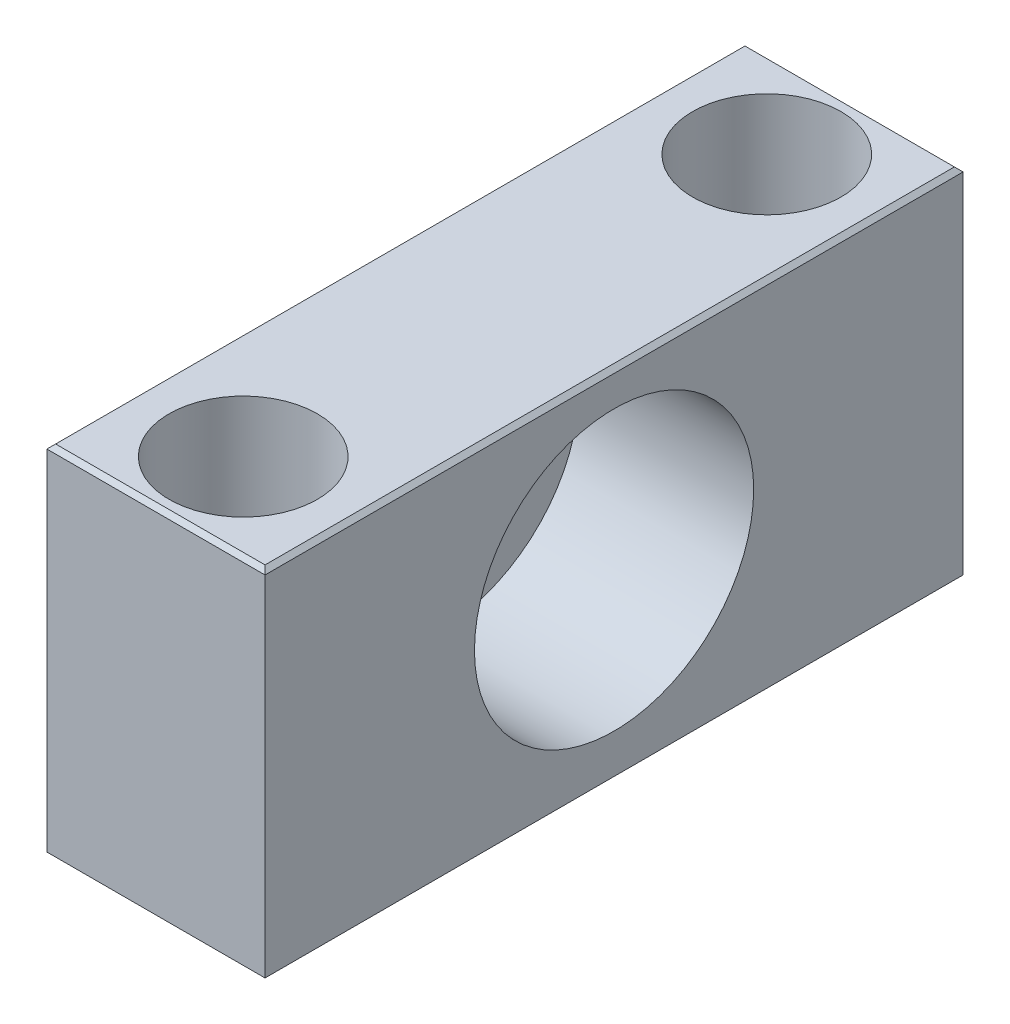
ISO-10303-21;
HEADER;
FILE_DESCRIPTION(('STEP AP214'),'2;1');
FILE_NAME('part.step','',(''),(''),'','','');
FILE_SCHEMA(('AUTOMOTIVE_DESIGN { 1 0 10303 214 1 1 1 1 }'));
ENDSEC;
DATA;
#1=APPLICATION_CONTEXT('core data for automotive mechanical design processes');
#2=APPLICATION_PROTOCOL_DEFINITION('international standard','automotive_design',2000,#1);
#3=PRODUCT_CONTEXT('',#1,'mechanical');
#4=PRODUCT('Part','Part','',(#3));
#5=PRODUCT_RELATED_PRODUCT_CATEGORY('part','',(#4));
#6=PRODUCT_DEFINITION_FORMATION('','',#4);
#7=PRODUCT_DEFINITION_CONTEXT('part definition',#1,'design');
#8=PRODUCT_DEFINITION('design','',#6,#7);
#9=PRODUCT_DEFINITION_SHAPE('','',#8);
#10=(LENGTH_UNIT() NAMED_UNIT(*) SI_UNIT(.MILLI.,.METRE.));
#11=(NAMED_UNIT(*) PLANE_ANGLE_UNIT() SI_UNIT($,.RADIAN.));
#12=(NAMED_UNIT(*) SI_UNIT($,.STERADIAN.) SOLID_ANGLE_UNIT());
#13=UNCERTAINTY_MEASURE_WITH_UNIT(LENGTH_MEASURE(1.E-05),#10,'distance_accuracy_value','');
#14=(GEOMETRIC_REPRESENTATION_CONTEXT(3) GLOBAL_UNCERTAINTY_ASSIGNED_CONTEXT((#13)) GLOBAL_UNIT_ASSIGNED_CONTEXT((#10,
#11,#12)) REPRESENTATION_CONTEXT('',''));
#15=CARTESIAN_POINT('',(0.,0.,0.));
#16=DIRECTION('',(0.,0.,1.));
#17=DIRECTION('',(1.,0.,0.));
#18=AXIS2_PLACEMENT_3D('',#15,#16,#17);
#19=CARTESIAN_POINT('',(19.5,-1.,30.));
#20=DIRECTION('',(0.,-1.,0.));
#21=DIRECTION('',(0.,0.,-1.));
#22=AXIS2_PLACEMENT_3D('',#19,#20,#21);
#23=PLANE('',#22);
#24=CARTESIAN_POINT('',(12.5,-1.,30.));
#25=DIRECTION('',(0.,-1.,0.));
#26=DIRECTION('',(0.,0.,-1.));
#27=AXIS2_PLACEMENT_3D('',#24,#25,#26);
#28=CIRCLE('',#27,5.5);
#29=CARTESIAN_POINT('',(12.5,-1.,24.5));
#30=VERTEX_POINT('',#29);
#31=EDGE_CURVE('E20',#30,#30,#28,.T.);
#32=ORIENTED_EDGE('',*,*,#31,.T.);
#33=EDGE_LOOP('',(#32));
#34=FACE_BOUND('',#33,.T.);
#35=CARTESIAN_POINT('',(12.5,-0.999999999999999,30.));
#36=DIRECTION('',(0.,-1.,0.));
#37=DIRECTION('',(0.,0.,-1.));
#38=AXIS2_PLACEMENT_3D('',#35,#36,#37);
#39=CIRCLE('',#38,8.5);
#40=CARTESIAN_POINT('',(12.5,-0.999999999999999,21.5));
#41=VERTEX_POINT('',#40);
#42=EDGE_CURVE('E148',#41,#41,#39,.F.);
#43=ORIENTED_EDGE('',*,*,#42,.T.);
#44=EDGE_LOOP('',(#43));
#45=FACE_BOUND('',#44,.T.);
#46=ADVANCED_FACE('F17',(#34,#45),#23,.F.);
#47=CARTESIAN_POINT('',(19.5,-1.,-30.));
#48=DIRECTION('',(0.,-1.,0.));
#49=DIRECTION('',(0.,0.,-1.));
#50=AXIS2_PLACEMENT_3D('',#47,#48,#49);
#51=PLANE('',#50);
#52=CARTESIAN_POINT('',(12.5,-1.,-30.));
#53=DIRECTION('',(0.,-1.,0.));
#54=DIRECTION('',(0.,0.,-1.));
#55=AXIS2_PLACEMENT_3D('',#52,#53,#54);
#56=CIRCLE('',#55,5.5);
#57=CARTESIAN_POINT('',(12.5,-1.,-35.5));
#58=VERTEX_POINT('',#57);
#59=EDGE_CURVE('E150',#58,#58,#56,.T.);
#60=ORIENTED_EDGE('',*,*,#59,.T.);
#61=EDGE_LOOP('',(#60));
#62=FACE_BOUND('',#61,.T.);
#63=CARTESIAN_POINT('',(12.5,-0.999999999999999,-30.));
#64=DIRECTION('',(0.,-1.,0.));
#65=DIRECTION('',(0.,0.,-1.));
#66=AXIS2_PLACEMENT_3D('',#63,#64,#65);
#67=CIRCLE('',#66,8.5);
#68=CARTESIAN_POINT('',(12.5,-0.999999999999999,-38.5));
#69=VERTEX_POINT('',#68);
#70=EDGE_CURVE('E145',#69,#69,#67,.F.);
#71=ORIENTED_EDGE('',*,*,#70,.T.);
#72=EDGE_LOOP('',(#71));
#73=FACE_BOUND('',#72,.T.);
#74=ADVANCED_FACE('F162',(#62,#73),#51,.F.);
#75=CARTESIAN_POINT('',(12.5,-11.,30.));
#76=DIRECTION('',(0.,-1.,0.));
#77=DIRECTION('',(0.,0.,-1.));
#78=AXIS2_PLACEMENT_3D('',#75,#76,#77);
#79=CYLINDRICAL_SURFACE('',#78,5.5);
#80=CARTESIAN_POINT('',(12.5,-21.,30.));
#81=DIRECTION('',(0.,-1.,0.));
#82=DIRECTION('',(0.,0.,-1.));
#83=AXIS2_PLACEMENT_3D('',#80,#81,#82);
#84=CIRCLE('',#83,5.5);
#85=CARTESIAN_POINT('',(12.5,-21.,24.5));
#86=VERTEX_POINT('',#85);
#87=EDGE_CURVE('E94',#86,#86,#84,.F.);
#88=ORIENTED_EDGE('',*,*,#87,.F.);
#89=EDGE_LOOP('',(#88));
#90=FACE_BOUND('',#89,.T.);
#91=ORIENTED_EDGE('',*,*,#31,.F.);
#92=EDGE_LOOP('',(#91));
#93=FACE_BOUND('',#92,.T.);
#94=ADVANCED_FACE('F159',(#90,#93),#79,.F.);
#95=CARTESIAN_POINT('',(12.5,-11.,-30.));
#96=DIRECTION('',(0.,-1.,0.));
#97=DIRECTION('',(0.,0.,-1.));
#98=AXIS2_PLACEMENT_3D('',#95,#96,#97);
#99=CYLINDRICAL_SURFACE('',#98,5.5);
#100=CARTESIAN_POINT('',(12.5,-21.,-30.));
#101=DIRECTION('',(0.,-1.,0.));
#102=DIRECTION('',(0.,0.,-1.));
#103=AXIS2_PLACEMENT_3D('',#100,#101,#102);
#104=CIRCLE('',#103,5.5);
#105=CARTESIAN_POINT('',(12.5,-21.,-35.5));
#106=VERTEX_POINT('',#105);
#107=EDGE_CURVE('E107',#106,#106,#104,.F.);
#108=ORIENTED_EDGE('',*,*,#107,.F.);
#109=EDGE_LOOP('',(#108));
#110=FACE_BOUND('',#109,.T.);
#111=ORIENTED_EDGE('',*,*,#59,.F.);
#112=EDGE_LOOP('',(#111));
#113=FACE_BOUND('',#112,.T.);
#114=ADVANCED_FACE('F161',(#110,#113),#99,.F.);
#115=CARTESIAN_POINT('',(15.,0.,0.));
#116=DIRECTION('',(1.,0.,0.));
#117=DIRECTION('',(0.,0.,-1.));
#118=AXIS2_PLACEMENT_3D('',#115,#116,#117);
#119=CYLINDRICAL_SURFACE('',#118,16.);
#120=CARTESIAN_POINT('',(25.,0.,0.));
#121=DIRECTION('',(1.,0.,0.));
#122=DIRECTION('',(0.,0.,-1.));
#123=AXIS2_PLACEMENT_3D('',#120,#121,#122);
#124=CIRCLE('',#123,16.);
#125=CARTESIAN_POINT('',(25.,0.,-16.));
#126=VERTEX_POINT('',#125);
#127=EDGE_CURVE('E137',#126,#126,#124,.F.);
#128=ORIENTED_EDGE('',*,*,#127,.F.);
#129=EDGE_LOOP('',(#128));
#130=FACE_BOUND('',#129,.T.);
#131=CARTESIAN_POINT('',(5.,0.,0.));
#132=DIRECTION('',(1.,0.,0.));
#133=DIRECTION('',(0.,0.,-1.));
#134=AXIS2_PLACEMENT_3D('',#131,#132,#133);
#135=CIRCLE('',#134,16.);
#136=CARTESIAN_POINT('',(5.,0.,-16.));
#137=VERTEX_POINT('',#136);
#138=EDGE_CURVE('E118',#137,#137,#135,.F.);
#139=ORIENTED_EDGE('',*,*,#138,.T.);
#140=EDGE_LOOP('',(#139));
#141=FACE_BOUND('',#140,.T.);
#142=ADVANCED_FACE('F170',(#130,#141),#119,.F.);
#143=CARTESIAN_POINT('',(24.5,-21.,40.));
#144=DIRECTION('',(0.707106781186548,-0.707106781186548,0.));
#145=DIRECTION('',(0.707106781186548,0.707106781186548,0.));
#146=AXIS2_PLACEMENT_3D('',#143,#144,#145);
#147=PLANE('',#146);
#148=DIRECTION('',(-0.577350269189626,-0.577350269189626,-0.577350269189626));
#149=VECTOR('',#148,1.);
#150=CARTESIAN_POINT('',(25.,-20.5,40.));
#151=LINE('',#150,#149);
#152=CARTESIAN_POINT('',(25.,-20.5,40.));
#153=VERTEX_POINT('',#152);
#154=CARTESIAN_POINT('',(24.5,-21.,39.5));
#155=VERTEX_POINT('',#154);
#156=EDGE_CURVE('E99',#153,#155,#151,.T.);
#157=ORIENTED_EDGE('',*,*,#156,.T.);
#158=DIRECTION('',(0.,0.,-1.));
#159=VECTOR('',#158,1.);
#160=CARTESIAN_POINT('',(24.5,-21.,40.));
#161=LINE('',#160,#159);
#162=CARTESIAN_POINT('',(24.5,-21.,-39.5));
#163=VERTEX_POINT('',#162);
#164=EDGE_CURVE('E79',#163,#155,#161,.F.);
#165=ORIENTED_EDGE('',*,*,#164,.F.);
#166=DIRECTION('',(0.577350269189626,0.577350269189626,-0.577350269189626));
#167=VECTOR('',#166,1.);
#168=CARTESIAN_POINT('',(24.5,-21.,-39.5));
#169=LINE('',#168,#167);
#170=CARTESIAN_POINT('',(25.,-20.5,-40.));
#171=VERTEX_POINT('',#170);
#172=EDGE_CURVE('E85',#163,#171,#169,.T.);
#173=ORIENTED_EDGE('',*,*,#172,.T.);
#174=DIRECTION('',(0.,0.,-1.));
#175=VECTOR('',#174,1.);
#176=CARTESIAN_POINT('',(25.,-20.5,40.));
#177=LINE('',#176,#175);
#178=EDGE_CURVE('E488',#153,#171,#177,.T.);
#179=ORIENTED_EDGE('',*,*,#178,.F.);
#180=EDGE_LOOP('',(#157,#165,#173,#179));
#181=FACE_BOUND('',#180,.T.);
#182=ADVANCED_FACE('F97',(#181),#147,.T.);
#183=CARTESIAN_POINT('',(12.5,9.5,30.));
#184=DIRECTION('',(0.,-1.,0.));
#185=DIRECTION('',(0.,0.,-1.));
#186=AXIS2_PLACEMENT_3D('',#183,#184,#185);
#187=CYLINDRICAL_SURFACE('',#186,8.5);
#188=CARTESIAN_POINT('',(12.5,20.,30.));
#189=DIRECTION('',(0.,-1.,0.));
#190=DIRECTION('',(0.,0.,-1.));
#191=AXIS2_PLACEMENT_3D('',#188,#189,#190);
#192=CIRCLE('',#191,8.5);
#193=CARTESIAN_POINT('',(12.5,20.,21.5));
#194=VERTEX_POINT('',#193);
#195=EDGE_CURVE('E133',#194,#194,#192,.T.);
#196=ORIENTED_EDGE('',*,*,#195,.F.);
#197=EDGE_LOOP('',(#196));
#198=FACE_BOUND('',#197,.T.);
#199=ORIENTED_EDGE('',*,*,#42,.F.);
#200=EDGE_LOOP('',(#199));
#201=FACE_BOUND('',#200,.T.);
#202=ADVANCED_FACE('F237',(#198,#201),#187,.F.);
#203=CARTESIAN_POINT('',(12.5,9.5,-30.));
#204=DIRECTION('',(0.,-1.,0.));
#205=DIRECTION('',(0.,0.,-1.));
#206=AXIS2_PLACEMENT_3D('',#203,#204,#205);
#207=CYLINDRICAL_SURFACE('',#206,8.5);
#208=CARTESIAN_POINT('',(12.5,20.,-30.));
#209=DIRECTION('',(0.,-1.,0.));
#210=DIRECTION('',(0.,0.,-1.));
#211=AXIS2_PLACEMENT_3D('',#208,#209,#210);
#212=CIRCLE('',#211,8.5);
#213=CARTESIAN_POINT('',(12.5,20.,-38.5));
#214=VERTEX_POINT('',#213);
#215=EDGE_CURVE('E129',#214,#214,#212,.T.);
#216=ORIENTED_EDGE('',*,*,#215,.F.);
#217=EDGE_LOOP('',(#216));
#218=FACE_BOUND('',#217,.T.);
#219=ORIENTED_EDGE('',*,*,#70,.F.);
#220=EDGE_LOOP('',(#219));
#221=FACE_BOUND('',#220,.T.);
#222=ADVANCED_FACE('F233',(#218,#221),#207,.F.);
#223=CARTESIAN_POINT('',(25.,19.5,40.));
#224=DIRECTION('',(0.707106781186548,0.707106781186548,0.));
#225=DIRECTION('',(-0.707106781186548,0.707106781186548,0.));
#226=AXIS2_PLACEMENT_3D('',#223,#224,#225);
#227=PLANE('',#226);
#228=DIRECTION('',(0.577350269189626,-0.577350269189626,0.577350269189626));
#229=VECTOR('',#228,1.);
#230=CARTESIAN_POINT('',(24.5,20.,39.5));
#231=LINE('',#230,#229);
#232=CARTESIAN_POINT('',(24.5,20.,39.5));
#233=VERTEX_POINT('',#232);
#234=CARTESIAN_POINT('',(25.,19.5,40.));
#235=VERTEX_POINT('',#234);
#236=EDGE_CURVE('E136',#233,#235,#231,.T.);
#237=ORIENTED_EDGE('',*,*,#236,.T.);
#238=DIRECTION('',(0.,0.,-1.));
#239=VECTOR('',#238,1.);
#240=CARTESIAN_POINT('',(25.,19.5,40.));
#241=LINE('',#240,#239);
#242=CARTESIAN_POINT('',(25.,19.5,-40.));
#243=VERTEX_POINT('',#242);
#244=EDGE_CURVE('E139',#243,#235,#241,.F.);
#245=ORIENTED_EDGE('',*,*,#244,.F.);
#246=DIRECTION('',(-0.577350269189626,0.577350269189626,0.577350269189626));
#247=VECTOR('',#246,1.);
#248=CARTESIAN_POINT('',(25.,19.5,-40.));
#249=LINE('',#248,#247);
#250=CARTESIAN_POINT('',(24.5,20.,-39.5));
#251=VERTEX_POINT('',#250);
#252=EDGE_CURVE('E114',#243,#251,#249,.T.);
#253=ORIENTED_EDGE('',*,*,#252,.T.);
#254=DIRECTION('',(0.,0.,1.));
#255=VECTOR('',#254,1.);
#256=CARTESIAN_POINT('',(24.5,20.,40.));
#257=LINE('',#256,#255);
#258=EDGE_CURVE('E128',#233,#251,#257,.F.);
#259=ORIENTED_EDGE('',*,*,#258,.F.);
#260=EDGE_LOOP('',(#237,#245,#253,#259));
#261=FACE_BOUND('',#260,.T.);
#262=ADVANCED_FACE('F229',(#261),#227,.T.);
#263=CARTESIAN_POINT('',(5.,13.,0.));
#264=DIRECTION('',(-1.,0.,0.));
#265=DIRECTION('',(0.,0.,1.));
#266=AXIS2_PLACEMENT_3D('',#263,#264,#265);
#267=PLANE('',#266);
#268=ORIENTED_EDGE('',*,*,#138,.F.);
#269=EDGE_LOOP('',(#268));
#270=FACE_BOUND('',#269,.T.);
#271=CARTESIAN_POINT('',(5.,0.,0.));
#272=DIRECTION('',(1.,0.,0.));
#273=DIRECTION('',(0.,0.,-1.));
#274=AXIS2_PLACEMENT_3D('',#271,#272,#273);
#275=CIRCLE('',#274,10.);
#276=CARTESIAN_POINT('',(5.,0.,-10.));
#277=VERTEX_POINT('',#276);
#278=EDGE_CURVE('E124',#277,#277,#275,.F.);
#279=ORIENTED_EDGE('',*,*,#278,.T.);
#280=EDGE_LOOP('',(#279));
#281=FACE_BOUND('',#280,.T.);
#282=ADVANCED_FACE('F225',(#270,#281),#267,.F.);
#283=CARTESIAN_POINT('',(41.,20.,-39.5));
#284=DIRECTION('',(0.,-0.707106781186548,0.707106781186548));
#285=DIRECTION('',(0.,-0.707106781186548,-0.707106781186548));
#286=AXIS2_PLACEMENT_3D('',#283,#284,#285);
#287=PLANE('',#286);
#288=DIRECTION('',(1.,0.,0.));
#289=VECTOR('',#288,1.);
#290=CARTESIAN_POINT('',(0.,19.5,-40.));
#291=LINE('',#290,#289);
#292=CARTESIAN_POINT('',(0.,19.5,-40.));
#293=VERTEX_POINT('',#292);
#294=EDGE_CURVE('E504',#243,#293,#291,.F.);
#295=ORIENTED_EDGE('',*,*,#294,.T.);
#296=DIRECTION('',(-0.577350269189626,-0.577350269189626,-0.577350269189626));
#297=VECTOR('',#296,1.);
#298=CARTESIAN_POINT('',(0.499999999999987,20.,-39.5));
#299=LINE('',#298,#297);
#300=CARTESIAN_POINT('',(0.49999999999999,20.,-39.5));
#301=VERTEX_POINT('',#300);
#302=EDGE_CURVE('E116',#301,#293,#299,.T.);
#303=ORIENTED_EDGE('',*,*,#302,.F.);
#304=DIRECTION('',(1.,0.,0.));
#305=VECTOR('',#304,1.);
#306=CARTESIAN_POINT('',(24.5,20.,-39.5));
#307=LINE('',#306,#305);
#308=EDGE_CURVE('E132',#251,#301,#307,.F.);
#309=ORIENTED_EDGE('',*,*,#308,.F.);
#310=ORIENTED_EDGE('',*,*,#252,.F.);
#311=EDGE_LOOP('',(#295,#303,#309,#310));
#312=FACE_BOUND('',#311,.T.);
#313=ADVANCED_FACE('F222',(#312),#287,.F.);
#314=CARTESIAN_POINT('',(41.,-20.5,-40.));
#315=DIRECTION('',(0.,0.707106781186548,0.707106781186548));
#316=DIRECTION('',(0.,-0.707106781186548,0.707106781186548));
#317=AXIS2_PLACEMENT_3D('',#314,#315,#316);
#318=PLANE('',#317);
#319=DIRECTION('',(1.,0.,0.));
#320=VECTOR('',#319,1.);
#321=CARTESIAN_POINT('',(0.5,-21.,-39.5));
#322=LINE('',#321,#320);
#323=CARTESIAN_POINT('',(0.499999999999985,-21.,-39.5));
#324=VERTEX_POINT('',#323);
#325=EDGE_CURVE('E87',#324,#163,#322,.T.);
#326=ORIENTED_EDGE('',*,*,#325,.F.);
#327=DIRECTION('',(0.577350269189626,-0.577350269189626,0.577350269189626));
#328=VECTOR('',#327,1.);
#329=CARTESIAN_POINT('',(0.,-20.5,-40.));
#330=LINE('',#329,#328);
#331=CARTESIAN_POINT('',(0.,-20.5,-40.));
#332=VERTEX_POINT('',#331);
#333=EDGE_CURVE('E95',#332,#324,#330,.T.);
#334=ORIENTED_EDGE('',*,*,#333,.F.);
#335=DIRECTION('',(1.,0.,0.));
#336=VECTOR('',#335,1.);
#337=CARTESIAN_POINT('',(0.,-20.5,-40.));
#338=LINE('',#337,#336);
#339=EDGE_CURVE('E90',#332,#171,#338,.T.);
#340=ORIENTED_EDGE('',*,*,#339,.T.);
#341=ORIENTED_EDGE('',*,*,#172,.F.);
#342=EDGE_LOOP('',(#326,#334,#340,#341));
#343=FACE_BOUND('',#342,.T.);
#344=ADVANCED_FACE('F86',(#343),#318,.F.);
#345=CARTESIAN_POINT('',(0.5,-21.,40.));
#346=DIRECTION('',(0.,-1.,0.));
#347=DIRECTION('',(0.,0.,-1.));
#348=AXIS2_PLACEMENT_3D('',#345,#346,#347);
#349=PLANE('',#348);
#350=DIRECTION('',(1.,0.,0.));
#351=VECTOR('',#350,1.);
#352=CARTESIAN_POINT('',(41.,-21.,39.5));
#353=LINE('',#352,#351);
#354=CARTESIAN_POINT('',(0.499999999999991,-21.,39.5));
#355=VERTEX_POINT('',#354);
#356=EDGE_CURVE('E101',#155,#355,#353,.F.);
#357=ORIENTED_EDGE('',*,*,#356,.T.);
#358=DIRECTION('',(0.,0.,1.));
#359=VECTOR('',#358,1.);
#360=CARTESIAN_POINT('',(0.5,-21.,40.));
#361=LINE('',#360,#359);
#362=EDGE_CURVE('E106',#324,#355,#361,.T.);
#363=ORIENTED_EDGE('',*,*,#362,.F.);
#364=ORIENTED_EDGE('',*,*,#325,.T.);
#365=ORIENTED_EDGE('',*,*,#164,.T.);
#366=EDGE_LOOP('',(#357,#363,#364,#365));
#367=FACE_BOUND('',#366,.T.);
#368=ORIENTED_EDGE('',*,*,#107,.T.);
#369=EDGE_LOOP('',(#368));
#370=FACE_BOUND('',#369,.T.);
#371=ORIENTED_EDGE('',*,*,#87,.T.);
#372=EDGE_LOOP('',(#371));
#373=FACE_BOUND('',#372,.T.);
#374=ADVANCED_FACE('F103',(#367,#370,#373),#349,.T.);
#375=CARTESIAN_POINT('',(41.,-21.,39.5));
#376=DIRECTION('',(0.,0.707106781186548,-0.707106781186548));
#377=DIRECTION('',(0.,0.707106781186548,0.707106781186548));
#378=AXIS2_PLACEMENT_3D('',#375,#376,#377);
#379=PLANE('',#378);
#380=DIRECTION('',(1.,0.,0.));
#381=VECTOR('',#380,1.);
#382=CARTESIAN_POINT('',(0.,-20.5,40.));
#383=LINE('',#382,#381);
#384=CARTESIAN_POINT('',(0.,-20.5,40.));
#385=VERTEX_POINT('',#384);
#386=EDGE_CURVE('E494',#385,#153,#383,.T.);
#387=ORIENTED_EDGE('',*,*,#386,.F.);
#388=DIRECTION('',(-0.577350269189626,0.577350269189626,0.577350269189626));
#389=VECTOR('',#388,1.);
#390=CARTESIAN_POINT('',(0.5,-21.,39.5));
#391=LINE('',#390,#389);
#392=EDGE_CURVE('E500',#355,#385,#391,.T.);
#393=ORIENTED_EDGE('',*,*,#392,.F.);
#394=ORIENTED_EDGE('',*,*,#356,.F.);
#395=ORIENTED_EDGE('',*,*,#156,.F.);
#396=EDGE_LOOP('',(#387,#393,#394,#395));
#397=FACE_BOUND('',#396,.T.);
#398=ADVANCED_FACE('F213',(#397),#379,.F.);
#399=CARTESIAN_POINT('',(25.,-20.5,40.));
#400=DIRECTION('',(1.,0.,0.));
#401=DIRECTION('',(0.,0.,-1.));
#402=AXIS2_PLACEMENT_3D('',#399,#400,#401);
#403=PLANE('',#402);
#404=DIRECTION('',(0.,1.,0.));
#405=VECTOR('',#404,1.);
#406=CARTESIAN_POINT('',(25.,0.,40.));
#407=LINE('',#406,#405);
#408=EDGE_CURVE('E485',#153,#235,#407,.T.);
#409=ORIENTED_EDGE('',*,*,#408,.F.);
#410=ORIENTED_EDGE('',*,*,#178,.T.);
#411=DIRECTION('',(0.,1.,0.));
#412=VECTOR('',#411,1.);
#413=CARTESIAN_POINT('',(25.,0.,-40.));
#414=LINE('',#413,#412);
#415=EDGE_CURVE('E127',#171,#243,#414,.T.);
#416=ORIENTED_EDGE('',*,*,#415,.T.);
#417=ORIENTED_EDGE('',*,*,#244,.T.);
#418=EDGE_LOOP('',(#409,#410,#416,#417));
#419=FACE_BOUND('',#418,.T.);
#420=ORIENTED_EDGE('',*,*,#127,.T.);
#421=EDGE_LOOP('',(#420));
#422=FACE_BOUND('',#421,.T.);
#423=ADVANCED_FACE('F210',(#419,#422),#403,.T.);
#424=CARTESIAN_POINT('',(41.,19.5,40.));
#425=DIRECTION('',(0.,-0.707106781186548,-0.707106781186548));
#426=DIRECTION('',(0.,0.707106781186548,-0.707106781186548));
#427=AXIS2_PLACEMENT_3D('',#424,#425,#426);
#428=PLANE('',#427);
#429=DIRECTION('',(1.,0.,0.));
#430=VECTOR('',#429,1.);
#431=CARTESIAN_POINT('',(24.5,20.,39.5));
#432=LINE('',#431,#430);
#433=CARTESIAN_POINT('',(0.499999999999987,20.,39.5));
#434=VERTEX_POINT('',#433);
#435=EDGE_CURVE('E509',#434,#233,#432,.T.);
#436=ORIENTED_EDGE('',*,*,#435,.F.);
#437=DIRECTION('',(0.577350269189626,0.577350269189626,-0.577350269189626));
#438=VECTOR('',#437,1.);
#439=CARTESIAN_POINT('',(0.,19.5,40.));
#440=LINE('',#439,#438);
#441=CARTESIAN_POINT('',(0.,19.5,40.));
#442=VERTEX_POINT('',#441);
#443=EDGE_CURVE('E35',#442,#434,#440,.T.);
#444=ORIENTED_EDGE('',*,*,#443,.F.);
#445=DIRECTION('',(1.,0.,0.));
#446=VECTOR('',#445,1.);
#447=CARTESIAN_POINT('',(0.,19.5,40.));
#448=LINE('',#447,#446);
#449=EDGE_CURVE('E490',#235,#442,#448,.F.);
#450=ORIENTED_EDGE('',*,*,#449,.F.);
#451=ORIENTED_EDGE('',*,*,#236,.F.);
#452=EDGE_LOOP('',(#436,#444,#450,#451));
#453=FACE_BOUND('',#452,.T.);
#454=ADVANCED_FACE('F206',(#453),#428,.F.);
#455=CARTESIAN_POINT('',(24.5,20.,40.));
#456=DIRECTION('',(0.,1.,0.));
#457=DIRECTION('',(0.,0.,1.));
#458=AXIS2_PLACEMENT_3D('',#455,#456,#457);
#459=PLANE('',#458);
#460=ORIENTED_EDGE('',*,*,#435,.T.);
#461=ORIENTED_EDGE('',*,*,#258,.T.);
#462=ORIENTED_EDGE('',*,*,#308,.T.);
#463=DIRECTION('',(0.,0.,1.));
#464=VECTOR('',#463,1.);
#465=CARTESIAN_POINT('',(0.5,20.,40.));
#466=LINE('',#465,#464);
#467=EDGE_CURVE('E123',#434,#301,#466,.F.);
#468=ORIENTED_EDGE('',*,*,#467,.F.);
#469=EDGE_LOOP('',(#460,#461,#462,#468));
#470=FACE_BOUND('',#469,.T.);
#471=ORIENTED_EDGE('',*,*,#215,.T.);
#472=EDGE_LOOP('',(#471));
#473=FACE_BOUND('',#472,.T.);
#474=ORIENTED_EDGE('',*,*,#195,.T.);
#475=EDGE_LOOP('',(#474));
#476=FACE_BOUND('',#475,.T.);
#477=ADVANCED_FACE('F202',(#470,#473,#476),#459,.T.);
#478=CARTESIAN_POINT('',(2.5,0.,0.));
#479=DIRECTION('',(1.,0.,0.));
#480=DIRECTION('',(0.,0.,-1.));
#481=AXIS2_PLACEMENT_3D('',#478,#479,#480);
#482=CYLINDRICAL_SURFACE('',#481,10.);
#483=CARTESIAN_POINT('',(0.,0.,0.));
#484=DIRECTION('',(1.,0.,0.));
#485=DIRECTION('',(0.,0.,-1.));
#486=AXIS2_PLACEMENT_3D('',#483,#484,#485);
#487=CIRCLE('',#486,10.);
#488=CARTESIAN_POINT('',(0.,0.,-10.));
#489=VERTEX_POINT('',#488);
#490=EDGE_CURVE('E119',#489,#489,#487,.T.);
#491=ORIENTED_EDGE('',*,*,#490,.F.);
#492=EDGE_LOOP('',(#491));
#493=FACE_BOUND('',#492,.T.);
#494=ORIENTED_EDGE('',*,*,#278,.F.);
#495=EDGE_LOOP('',(#494));
#496=FACE_BOUND('',#495,.T.);
#497=ADVANCED_FACE('F198',(#493,#496),#482,.F.);
#498=CARTESIAN_POINT('',(0.,0.,-40.));
#499=DIRECTION('',(0.,0.,1.));
#500=DIRECTION('',(1.,0.,0.));
#501=AXIS2_PLACEMENT_3D('',#498,#499,#500);
#502=PLANE('',#501);
#503=DIRECTION('',(0.,1.,0.));
#504=VECTOR('',#503,1.);
#505=CARTESIAN_POINT('',(0.,19.5,-40.));
#506=LINE('',#505,#504);
#507=EDGE_CURVE('E122',#293,#332,#506,.F.);
#508=ORIENTED_EDGE('',*,*,#507,.F.);
#509=ORIENTED_EDGE('',*,*,#294,.F.);
#510=ORIENTED_EDGE('',*,*,#415,.F.);
#511=ORIENTED_EDGE('',*,*,#339,.F.);
#512=EDGE_LOOP('',(#508,#509,#510,#511));
#513=FACE_BOUND('',#512,.T.);
#514=ADVANCED_FACE('F194',(#513),#502,.F.);
#515=CARTESIAN_POINT('',(0.,-20.5,40.));
#516=DIRECTION('',(-0.707106781186548,-0.707106781186548,0.));
#517=DIRECTION('',(0.707106781186548,-0.707106781186548,0.));
#518=AXIS2_PLACEMENT_3D('',#515,#516,#517);
#519=PLANE('',#518);
#520=ORIENTED_EDGE('',*,*,#333,.T.);
#521=ORIENTED_EDGE('',*,*,#362,.T.);
#522=ORIENTED_EDGE('',*,*,#392,.T.);
#523=DIRECTION('',(0.,0.,1.));
#524=VECTOR('',#523,1.);
#525=CARTESIAN_POINT('',(0.,-20.5,40.));
#526=LINE('',#525,#524);
#527=EDGE_CURVE('E518',#332,#385,#526,.T.);
#528=ORIENTED_EDGE('',*,*,#527,.F.);
#529=EDGE_LOOP('',(#520,#521,#522,#528));
#530=FACE_BOUND('',#529,.T.);
#531=ADVANCED_FACE('F190',(#530),#519,.T.);
#532=CARTESIAN_POINT('',(0.,0.,40.));
#533=DIRECTION('',(0.,0.,1.));
#534=DIRECTION('',(1.,0.,0.));
#535=AXIS2_PLACEMENT_3D('',#532,#533,#534);
#536=PLANE('',#535);
#537=ORIENTED_EDGE('',*,*,#449,.T.);
#538=DIRECTION('',(0.,1.,0.));
#539=VECTOR('',#538,1.);
#540=CARTESIAN_POINT('',(0.,19.5,40.));
#541=LINE('',#540,#539);
#542=EDGE_CURVE('E26',#385,#442,#541,.T.);
#543=ORIENTED_EDGE('',*,*,#542,.F.);
#544=ORIENTED_EDGE('',*,*,#386,.T.);
#545=ORIENTED_EDGE('',*,*,#408,.T.);
#546=EDGE_LOOP('',(#537,#543,#544,#545));
#547=FACE_BOUND('',#546,.T.);
#548=ADVANCED_FACE('F182',(#547),#536,.T.);
#549=CARTESIAN_POINT('',(0.5,20.,40.));
#550=DIRECTION('',(-0.707106781186548,0.707106781186548,0.));
#551=DIRECTION('',(-0.707106781186548,-0.707106781186548,0.));
#552=AXIS2_PLACEMENT_3D('',#549,#550,#551);
#553=PLANE('',#552);
#554=ORIENTED_EDGE('',*,*,#302,.T.);
#555=DIRECTION('',(0.,0.,1.));
#556=VECTOR('',#555,1.);
#557=CARTESIAN_POINT('',(0.,19.5,40.));
#558=LINE('',#557,#556);
#559=EDGE_CURVE('E11',#442,#293,#558,.F.);
#560=ORIENTED_EDGE('',*,*,#559,.F.);
#561=ORIENTED_EDGE('',*,*,#443,.T.);
#562=ORIENTED_EDGE('',*,*,#467,.T.);
#563=EDGE_LOOP('',(#554,#560,#561,#562));
#564=FACE_BOUND('',#563,.T.);
#565=ADVANCED_FACE('F176',(#564),#553,.T.);
#566=CARTESIAN_POINT('',(0.,19.5,40.));
#567=DIRECTION('',(-1.,0.,0.));
#568=DIRECTION('',(0.,0.,1.));
#569=AXIS2_PLACEMENT_3D('',#566,#567,#568);
#570=PLANE('',#569);
#571=ORIENTED_EDGE('',*,*,#542,.T.);
#572=ORIENTED_EDGE('',*,*,#559,.T.);
#573=ORIENTED_EDGE('',*,*,#507,.T.);
#574=ORIENTED_EDGE('',*,*,#527,.T.);
#575=EDGE_LOOP('',(#571,#572,#573,#574));
#576=FACE_BOUND('',#575,.T.);
#577=ORIENTED_EDGE('',*,*,#490,.T.);
#578=EDGE_LOOP('',(#577));
#579=FACE_BOUND('',#578,.T.);
#580=ADVANCED_FACE('F174',(#576,#579),#570,.T.);
#581=CLOSED_SHELL('',(#46,#74,#94,#114,#142,#182,#202,#222,#262,#282,#313,#344,#374,#398,#423,
#454,#477,#497,#514,#531,#548,#565,#580));
#582=MANIFOLD_SOLID_BREP('B1',#581);
#583=ADVANCED_BREP_SHAPE_REPRESENTATION('',(#18,#582),#14);
#584=SHAPE_DEFINITION_REPRESENTATION(#9,#583);
ENDSEC;
END-ISO-10303-21;
